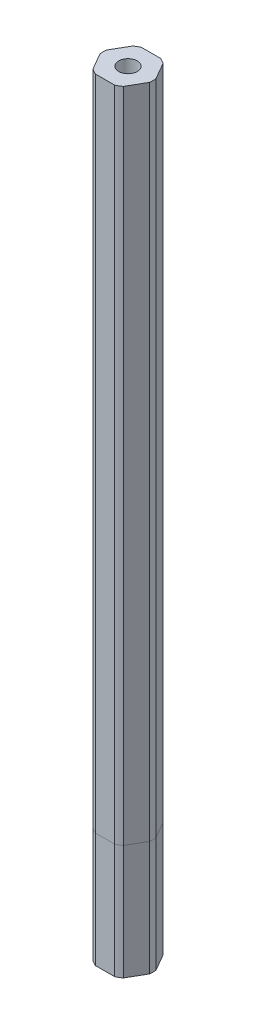
ISO-10303-21;
HEADER;
FILE_DESCRIPTION(('STEP AP214'),'2;1');
FILE_NAME('part.step','',(''),(''),'','','');
FILE_SCHEMA(('AUTOMOTIVE_DESIGN { 1 0 10303 214 1 1 1 1 }'));
ENDSEC;
DATA;
#1=APPLICATION_CONTEXT('core data for automotive mechanical design processes');
#2=APPLICATION_PROTOCOL_DEFINITION('international standard','automotive_design',2000,#1);
#3=PRODUCT_CONTEXT('',#1,'mechanical');
#4=PRODUCT('Part','Part','',(#3));
#5=PRODUCT_RELATED_PRODUCT_CATEGORY('part','',(#4));
#6=PRODUCT_DEFINITION_FORMATION('','',#4);
#7=PRODUCT_DEFINITION_CONTEXT('part definition',#1,'design');
#8=PRODUCT_DEFINITION('design','',#6,#7);
#9=PRODUCT_DEFINITION_SHAPE('','',#8);
#10=(LENGTH_UNIT() NAMED_UNIT(*) SI_UNIT(.MILLI.,.METRE.));
#11=(NAMED_UNIT(*) PLANE_ANGLE_UNIT() SI_UNIT($,.RADIAN.));
#12=(NAMED_UNIT(*) SI_UNIT($,.STERADIAN.) SOLID_ANGLE_UNIT());
#13=UNCERTAINTY_MEASURE_WITH_UNIT(LENGTH_MEASURE(1.E-05),#10,'distance_accuracy_value','');
#14=(GEOMETRIC_REPRESENTATION_CONTEXT(3) GLOBAL_UNCERTAINTY_ASSIGNED_CONTEXT((#13)) GLOBAL_UNIT_ASSIGNED_CONTEXT((#10,
#11,#12)) REPRESENTATION_CONTEXT('',''));
#15=CARTESIAN_POINT('',(0.,0.,0.));
#16=DIRECTION('',(0.,0.,1.));
#17=DIRECTION('',(1.,0.,0.));
#18=AXIS2_PLACEMENT_3D('',#15,#16,#17);
#19=CARTESIAN_POINT('',(0.,212.725,0.));
#20=DIRECTION('',(0.,1.,0.));
#21=DIRECTION('',(0.,0.,1.));
#22=AXIS2_PLACEMENT_3D('',#19,#20,#21);
#23=PLANE('',#22);
#24=CARTESIAN_POINT('',(0.,212.725,0.));
#25=DIRECTION('',(0.,1.,0.));
#26=DIRECTION('',(0.,0.,1.));
#27=AXIS2_PLACEMENT_3D('',#24,#25,#26);
#28=CIRCLE('',#27,6.87578);
#29=CARTESIAN_POINT('',(4.18075357719381,212.725,-5.45872239037498));
#30=VERTEX_POINT('',#29);
#31=CARTESIAN_POINT('',(2.63701547367471,212.725,-6.35000000000001));
#32=VERTEX_POINT('',#31);
#33=EDGE_CURVE('E189',#30,#32,#28,.T.);
#34=ORIENTED_EDGE('',*,*,#33,.T.);
#35=DIRECTION('',(-1.,0.,0.));
#36=VECTOR('',#35,1.);
#37=CARTESIAN_POINT('',(2.63701547367471,212.725,-6.35000000000001));
#38=LINE('',#37,#36);
#39=CARTESIAN_POINT('',(-2.63701547367476,212.725,-6.34999999999999));
#40=VERTEX_POINT('',#39);
#41=EDGE_CURVE('E117',#32,#40,#38,.T.);
#42=ORIENTED_EDGE('',*,*,#41,.T.);
#43=CARTESIAN_POINT('',(0.,212.725,0.));
#44=DIRECTION('',(0.,1.,0.));
#45=DIRECTION('',(0.,0.,1.));
#46=AXIS2_PLACEMENT_3D('',#43,#44,#45);
#47=CIRCLE('',#46,6.87578);
#48=CARTESIAN_POINT('',(-4.18075357719384,212.725,-5.45872239037496));
#49=VERTEX_POINT('',#48);
#50=EDGE_CURVE('E216',#40,#49,#47,.T.);
#51=ORIENTED_EDGE('',*,*,#50,.T.);
#52=DIRECTION('',(-0.499999999999995,0.,0.866025403784441));
#53=VECTOR('',#52,1.);
#54=CARTESIAN_POINT('',(-4.18075357719384,212.725,-5.45872239037496));
#55=LINE('',#54,#53);
#56=CARTESIAN_POINT('',(-6.81776905086856,212.725,-0.891277609624982));
#57=VERTEX_POINT('',#56);
#58=EDGE_CURVE('E235',#49,#57,#55,.T.);
#59=ORIENTED_EDGE('',*,*,#58,.T.);
#60=CARTESIAN_POINT('',(0.,212.725,0.));
#61=DIRECTION('',(0.,1.,0.));
#62=DIRECTION('',(0.,0.,1.));
#63=AXIS2_PLACEMENT_3D('',#60,#61,#62);
#64=CIRCLE('',#63,6.87578);
#65=CARTESIAN_POINT('',(-6.81776905086855,212.725,0.891277609625074));
#66=VERTEX_POINT('',#65);
#67=EDGE_CURVE('E232',#57,#66,#64,.T.);
#68=ORIENTED_EDGE('',*,*,#67,.T.);
#69=DIRECTION('',(0.500000000000007,0.,0.866025403784435));
#70=VECTOR('',#69,1.);
#71=CARTESIAN_POINT('',(-6.81776905086855,212.725,0.891277609625074));
#72=LINE('',#71,#70);
#73=CARTESIAN_POINT('',(-4.18075357719377,212.725,5.45872239037501));
#74=VERTEX_POINT('',#73);
#75=EDGE_CURVE('E234',#66,#74,#72,.T.);
#76=ORIENTED_EDGE('',*,*,#75,.T.);
#77=CARTESIAN_POINT('',(0.,212.725,0.));
#78=DIRECTION('',(0.,1.,0.));
#79=DIRECTION('',(0.,0.,1.));
#80=AXIS2_PLACEMENT_3D('',#77,#78,#79);
#81=CIRCLE('',#80,6.87578);
#82=CARTESIAN_POINT('',(-2.63701547367468,212.725,6.35000000000002));
#83=VERTEX_POINT('',#82);
#84=EDGE_CURVE('E237',#74,#83,#81,.T.);
#85=ORIENTED_EDGE('',*,*,#84,.T.);
#86=DIRECTION('',(1.,0.,0.));
#87=VECTOR('',#86,1.);
#88=CARTESIAN_POINT('',(-2.63701547367468,212.725,6.35000000000002));
#89=LINE('',#88,#87);
#90=CARTESIAN_POINT('',(2.6370154736748,212.725,6.34999999999997));
#91=VERTEX_POINT('',#90);
#92=EDGE_CURVE('E243',#83,#91,#89,.T.);
#93=ORIENTED_EDGE('',*,*,#92,.T.);
#94=CARTESIAN_POINT('',(0.,212.725,0.));
#95=DIRECTION('',(0.,1.,0.));
#96=DIRECTION('',(0.,0.,1.));
#97=AXIS2_PLACEMENT_3D('',#94,#95,#96);
#98=CIRCLE('',#97,6.87578);
#99=CARTESIAN_POINT('',(4.1807535771939,212.725,5.45872239037491));
#100=VERTEX_POINT('',#99);
#101=EDGE_CURVE('E148',#91,#100,#98,.T.);
#102=ORIENTED_EDGE('',*,*,#101,.T.);
#103=DIRECTION('',(0.499999999999995,0.,-0.866025403784441));
#104=VECTOR('',#103,1.);
#105=CARTESIAN_POINT('',(4.1807535771939,212.725,5.45872239037491));
#106=LINE('',#105,#104);
#107=CARTESIAN_POINT('',(6.81776905086855,212.725,0.891277609625056));
#108=VERTEX_POINT('',#107);
#109=EDGE_CURVE('E142',#100,#108,#106,.T.);
#110=ORIENTED_EDGE('',*,*,#109,.T.);
#111=CARTESIAN_POINT('',(0.,212.725,0.));
#112=DIRECTION('',(0.,1.,0.));
#113=DIRECTION('',(0.,0.,1.));
#114=AXIS2_PLACEMENT_3D('',#111,#112,#113);
#115=CIRCLE('',#114,6.87578);
#116=CARTESIAN_POINT('',(6.81776905086855,212.725,-0.891277609625029));
#117=VERTEX_POINT('',#116);
#118=EDGE_CURVE('E146',#108,#117,#115,.T.);
#119=ORIENTED_EDGE('',*,*,#118,.T.);
#120=DIRECTION('',(-0.500000000000001,0.,-0.866025403784438));
#121=VECTOR('',#120,1.);
#122=CARTESIAN_POINT('',(6.81776905086855,212.725,-0.891277609625029));
#123=LINE('',#122,#121);
#124=EDGE_CURVE('E62',#117,#30,#123,.T.);
#125=ORIENTED_EDGE('',*,*,#124,.T.);
#126=EDGE_LOOP('',(#34,#42,#51,#59,#68,#76,#85,#93,#102,#110,#119,#125));
#127=FACE_BOUND('',#126,.T.);
#128=CARTESIAN_POINT('',(0.,212.725,0.));
#129=DIRECTION('',(0.,1.,0.));
#130=DIRECTION('',(0.,0.,1.));
#131=AXIS2_PLACEMENT_3D('',#128,#129,#130);
#132=CIRCLE('',#131,2.5527);
#133=CARTESIAN_POINT('',(0.,212.725,2.5527));
#134=VERTEX_POINT('',#133);
#135=EDGE_CURVE('E170',#134,#134,#132,.T.);
#136=ORIENTED_EDGE('',*,*,#135,.F.);
#137=EDGE_LOOP('',(#136));
#138=FACE_BOUND('',#137,.T.);
#139=ADVANCED_FACE('F45',(#127,#138),#23,.T.);
#140=CARTESIAN_POINT('',(0.,31.623,0.));
#141=DIRECTION('',(0.,1.,0.));
#142=DIRECTION('',(0.,0.,1.));
#143=AXIS2_PLACEMENT_3D('',#140,#141,#142);
#144=PLANE('',#143);
#145=CARTESIAN_POINT('',(0.,31.623,0.));
#146=DIRECTION('',(0.,1.,0.));
#147=DIRECTION('',(0.,0.,1.));
#148=AXIS2_PLACEMENT_3D('',#145,#146,#147);
#149=CIRCLE('',#148,6.87578);
#150=CARTESIAN_POINT('',(4.18075357719381,31.623,-5.45872239037498));
#151=VERTEX_POINT('',#150);
#152=CARTESIAN_POINT('',(2.63701547367471,31.623,-6.35000000000001));
#153=VERTEX_POINT('',#152);
#154=EDGE_CURVE('E166',#151,#153,#149,.T.);
#155=ORIENTED_EDGE('',*,*,#154,.F.);
#156=DIRECTION('',(-0.500000000000001,0.,-0.866025403784438));
#157=VECTOR('',#156,1.);
#158=CARTESIAN_POINT('',(6.81776905086855,31.623,-0.891277609625029));
#159=LINE('',#158,#157);
#160=CARTESIAN_POINT('',(6.81776905086855,31.623,-0.891277609625029));
#161=VERTEX_POINT('',#160);
#162=EDGE_CURVE('E109',#161,#151,#159,.T.);
#163=ORIENTED_EDGE('',*,*,#162,.F.);
#164=CARTESIAN_POINT('',(0.,31.623,0.));
#165=DIRECTION('',(0.,1.,0.));
#166=DIRECTION('',(0.,0.,1.));
#167=AXIS2_PLACEMENT_3D('',#164,#165,#166);
#168=CIRCLE('',#167,6.87578);
#169=CARTESIAN_POINT('',(6.81776905086855,31.623,0.891277609625056));
#170=VERTEX_POINT('',#169);
#171=EDGE_CURVE('E103',#170,#161,#168,.T.);
#172=ORIENTED_EDGE('',*,*,#171,.F.);
#173=DIRECTION('',(0.499999999999995,0.,-0.866025403784441));
#174=VECTOR('',#173,1.);
#175=CARTESIAN_POINT('',(4.1807535771939,31.623,5.45872239037491));
#176=LINE('',#175,#174);
#177=CARTESIAN_POINT('',(4.1807535771939,31.623,5.45872239037491));
#178=VERTEX_POINT('',#177);
#179=EDGE_CURVE('E156',#178,#170,#176,.T.);
#180=ORIENTED_EDGE('',*,*,#179,.F.);
#181=CARTESIAN_POINT('',(0.,31.623,0.));
#182=DIRECTION('',(0.,1.,0.));
#183=DIRECTION('',(0.,0.,1.));
#184=AXIS2_PLACEMENT_3D('',#181,#182,#183);
#185=CIRCLE('',#184,6.87578);
#186=CARTESIAN_POINT('',(2.6370154736748,31.623,6.34999999999997));
#187=VERTEX_POINT('',#186);
#188=EDGE_CURVE('E184',#187,#178,#185,.T.);
#189=ORIENTED_EDGE('',*,*,#188,.F.);
#190=DIRECTION('',(1.,0.,0.));
#191=VECTOR('',#190,1.);
#192=CARTESIAN_POINT('',(-2.63701547367468,31.623,6.35000000000002));
#193=LINE('',#192,#191);
#194=CARTESIAN_POINT('',(-2.63701547367468,31.623,6.35000000000002));
#195=VERTEX_POINT('',#194);
#196=EDGE_CURVE('E182',#195,#187,#193,.T.);
#197=ORIENTED_EDGE('',*,*,#196,.F.);
#198=CARTESIAN_POINT('',(0.,31.623,0.));
#199=DIRECTION('',(0.,1.,0.));
#200=DIRECTION('',(0.,0.,1.));
#201=AXIS2_PLACEMENT_3D('',#198,#199,#200);
#202=CIRCLE('',#201,6.87578);
#203=CARTESIAN_POINT('',(-4.18075357719377,31.623,5.45872239037501));
#204=VERTEX_POINT('',#203);
#205=EDGE_CURVE('E180',#204,#195,#202,.T.);
#206=ORIENTED_EDGE('',*,*,#205,.F.);
#207=DIRECTION('',(0.500000000000007,0.,0.866025403784435));
#208=VECTOR('',#207,1.);
#209=CARTESIAN_POINT('',(-6.81776905086855,31.623,0.891277609625074));
#210=LINE('',#209,#208);
#211=CARTESIAN_POINT('',(-6.81776905086855,31.623,0.891277609625074));
#212=VERTEX_POINT('',#211);
#213=EDGE_CURVE('E178',#212,#204,#210,.T.);
#214=ORIENTED_EDGE('',*,*,#213,.F.);
#215=CARTESIAN_POINT('',(0.,31.623,0.));
#216=DIRECTION('',(0.,1.,0.));
#217=DIRECTION('',(0.,0.,1.));
#218=AXIS2_PLACEMENT_3D('',#215,#216,#217);
#219=CIRCLE('',#218,6.87578);
#220=CARTESIAN_POINT('',(-6.81776905086856,31.623,-0.891277609624982));
#221=VERTEX_POINT('',#220);
#222=EDGE_CURVE('E176',#221,#212,#219,.T.);
#223=ORIENTED_EDGE('',*,*,#222,.F.);
#224=DIRECTION('',(-0.499999999999995,0.,0.866025403784441));
#225=VECTOR('',#224,1.);
#226=CARTESIAN_POINT('',(-4.18075357719384,31.623,-5.45872239037496));
#227=LINE('',#226,#225);
#228=CARTESIAN_POINT('',(-4.18075357719384,31.623,-5.45872239037496));
#229=VERTEX_POINT('',#228);
#230=EDGE_CURVE('E174',#229,#221,#227,.T.);
#231=ORIENTED_EDGE('',*,*,#230,.F.);
#232=CARTESIAN_POINT('',(0.,31.623,0.));
#233=DIRECTION('',(0.,1.,0.));
#234=DIRECTION('',(0.,0.,1.));
#235=AXIS2_PLACEMENT_3D('',#232,#233,#234);
#236=CIRCLE('',#235,6.87578);
#237=CARTESIAN_POINT('',(-2.63701547367476,31.623,-6.34999999999999));
#238=VERTEX_POINT('',#237);
#239=EDGE_CURVE('E172',#238,#229,#236,.T.);
#240=ORIENTED_EDGE('',*,*,#239,.F.);
#241=DIRECTION('',(-1.,0.,0.));
#242=VECTOR('',#241,1.);
#243=CARTESIAN_POINT('',(2.63701547367471,31.623,-6.35000000000001));
#244=LINE('',#243,#242);
#245=EDGE_CURVE('E169',#153,#238,#244,.T.);
#246=ORIENTED_EDGE('',*,*,#245,.F.);
#247=EDGE_LOOP('',(#155,#163,#172,#180,#189,#197,#206,#214,#223,#231,#240,#246));
#248=FACE_BOUND('',#247,.T.);
#249=CARTESIAN_POINT('',(0.,31.623,0.));
#250=DIRECTION('',(0.,1.,0.));
#251=DIRECTION('',(0.,0.,1.));
#252=AXIS2_PLACEMENT_3D('',#249,#250,#251);
#253=CIRCLE('',#252,2.5527);
#254=CARTESIAN_POINT('',(0.,31.623,2.5527));
#255=VERTEX_POINT('',#254);
#256=EDGE_CURVE('E390',#255,#255,#253,.T.);
#257=ORIENTED_EDGE('',*,*,#256,.T.);
#258=EDGE_LOOP('',(#257));
#259=FACE_BOUND('',#258,.T.);
#260=ADVANCED_FACE('F220',(#248,#259),#144,.F.);
#261=CARTESIAN_POINT('',(0.,212.725,0.));
#262=DIRECTION('',(0.,-1.,0.));
#263=DIRECTION('',(0.,0.,-1.));
#264=AXIS2_PLACEMENT_3D('',#261,#262,#263);
#265=CYLINDRICAL_SURFACE('',#264,6.87578);
#266=ORIENTED_EDGE('',*,*,#154,.T.);
#267=DIRECTION('',(0.,-1.,0.));
#268=VECTOR('',#267,1.);
#269=CARTESIAN_POINT('',(2.63701547367471,212.725,-6.35000000000001));
#270=LINE('',#269,#268);
#271=EDGE_CURVE('E12',#32,#153,#270,.T.);
#272=ORIENTED_EDGE('',*,*,#271,.F.);
#273=ORIENTED_EDGE('',*,*,#33,.F.);
#274=DIRECTION('',(0.,-1.,0.));
#275=VECTOR('',#274,1.);
#276=CARTESIAN_POINT('',(4.18075357719381,212.725,-5.45872239037498));
#277=LINE('',#276,#275);
#278=EDGE_CURVE('E162',#30,#151,#277,.T.);
#279=ORIENTED_EDGE('',*,*,#278,.T.);
#280=EDGE_LOOP('',(#266,#272,#273,#279));
#281=FACE_BOUND('',#280,.T.);
#282=ADVANCED_FACE('F47',(#281),#265,.T.);
#283=CARTESIAN_POINT('',(2.63701547367471,212.725,-6.35000000000001));
#284=DIRECTION('',(0.,0.,1.));
#285=DIRECTION('',(1.,0.,0.));
#286=AXIS2_PLACEMENT_3D('',#283,#284,#285);
#287=PLANE('',#286);
#288=ORIENTED_EDGE('',*,*,#245,.T.);
#289=DIRECTION('',(0.,-1.,0.));
#290=VECTOR('',#289,1.);
#291=CARTESIAN_POINT('',(-2.63701547367476,212.725,-6.34999999999999));
#292=LINE('',#291,#290);
#293=EDGE_CURVE('E54',#40,#238,#292,.T.);
#294=ORIENTED_EDGE('',*,*,#293,.F.);
#295=ORIENTED_EDGE('',*,*,#41,.F.);
#296=ORIENTED_EDGE('',*,*,#271,.T.);
#297=EDGE_LOOP('',(#288,#294,#295,#296));
#298=FACE_BOUND('',#297,.T.);
#299=ADVANCED_FACE('F277',(#298),#287,.F.);
#300=CARTESIAN_POINT('',(0.,212.725,0.));
#301=DIRECTION('',(0.,-1.,0.));
#302=DIRECTION('',(0.,0.,-1.));
#303=AXIS2_PLACEMENT_3D('',#300,#301,#302);
#304=CYLINDRICAL_SURFACE('',#303,6.87578);
#305=ORIENTED_EDGE('',*,*,#239,.T.);
#306=DIRECTION('',(0.,-1.,0.));
#307=VECTOR('',#306,1.);
#308=CARTESIAN_POINT('',(-4.18075357719384,212.725,-5.45872239037496));
#309=LINE('',#308,#307);
#310=EDGE_CURVE('E208',#49,#229,#309,.T.);
#311=ORIENTED_EDGE('',*,*,#310,.F.);
#312=ORIENTED_EDGE('',*,*,#50,.F.);
#313=ORIENTED_EDGE('',*,*,#293,.T.);
#314=EDGE_LOOP('',(#305,#311,#312,#313));
#315=FACE_BOUND('',#314,.T.);
#316=ADVANCED_FACE('F214',(#315),#304,.T.);
#317=CARTESIAN_POINT('',(-4.18075357719384,212.725,-5.45872239037496));
#318=DIRECTION('',(0.866025403784441,0.,0.499999999999995));
#319=DIRECTION('',(0.499999999999995,0.,-0.866025403784442));
#320=AXIS2_PLACEMENT_3D('',#317,#318,#319);
#321=PLANE('',#320);
#322=ORIENTED_EDGE('',*,*,#230,.T.);
#323=DIRECTION('',(0.,-1.,0.));
#324=VECTOR('',#323,1.);
#325=CARTESIAN_POINT('',(-6.81776905086856,212.725,-0.891277609624982));
#326=LINE('',#325,#324);
#327=EDGE_CURVE('E205',#57,#221,#326,.T.);
#328=ORIENTED_EDGE('',*,*,#327,.F.);
#329=ORIENTED_EDGE('',*,*,#58,.F.);
#330=ORIENTED_EDGE('',*,*,#310,.T.);
#331=EDGE_LOOP('',(#322,#328,#329,#330));
#332=FACE_BOUND('',#331,.T.);
#333=ADVANCED_FACE('F226',(#332),#321,.F.);
#334=CARTESIAN_POINT('',(0.,212.725,0.));
#335=DIRECTION('',(0.,-1.,0.));
#336=DIRECTION('',(0.,0.,-1.));
#337=AXIS2_PLACEMENT_3D('',#334,#335,#336);
#338=CYLINDRICAL_SURFACE('',#337,6.87578);
#339=ORIENTED_EDGE('',*,*,#222,.T.);
#340=DIRECTION('',(0.,-1.,0.));
#341=VECTOR('',#340,1.);
#342=CARTESIAN_POINT('',(-6.81776905086855,212.725,0.891277609625074));
#343=LINE('',#342,#341);
#344=EDGE_CURVE('E202',#66,#212,#343,.T.);
#345=ORIENTED_EDGE('',*,*,#344,.F.);
#346=ORIENTED_EDGE('',*,*,#67,.F.);
#347=ORIENTED_EDGE('',*,*,#327,.T.);
#348=EDGE_LOOP('',(#339,#345,#346,#347));
#349=FACE_BOUND('',#348,.T.);
#350=ADVANCED_FACE('F230',(#349),#338,.T.);
#351=CARTESIAN_POINT('',(-6.81776905086855,212.725,0.891277609625074));
#352=DIRECTION('',(0.866025403784435,0.,-0.500000000000007));
#353=DIRECTION('',(-0.500000000000007,0.,-0.866025403784435));
#354=AXIS2_PLACEMENT_3D('',#351,#352,#353);
#355=PLANE('',#354);
#356=ORIENTED_EDGE('',*,*,#213,.T.);
#357=DIRECTION('',(0.,-1.,0.));
#358=VECTOR('',#357,1.);
#359=CARTESIAN_POINT('',(-4.18075357719377,212.725,5.45872239037501));
#360=LINE('',#359,#358);
#361=EDGE_CURVE('E199',#74,#204,#360,.T.);
#362=ORIENTED_EDGE('',*,*,#361,.F.);
#363=ORIENTED_EDGE('',*,*,#75,.F.);
#364=ORIENTED_EDGE('',*,*,#344,.T.);
#365=EDGE_LOOP('',(#356,#362,#363,#364));
#366=FACE_BOUND('',#365,.T.);
#367=ADVANCED_FACE('F290',(#366),#355,.F.);
#368=CARTESIAN_POINT('',(0.,212.725,0.));
#369=DIRECTION('',(0.,-1.,0.));
#370=DIRECTION('',(0.,0.,-1.));
#371=AXIS2_PLACEMENT_3D('',#368,#369,#370);
#372=CYLINDRICAL_SURFACE('',#371,6.87578);
#373=ORIENTED_EDGE('',*,*,#205,.T.);
#374=DIRECTION('',(0.,-1.,0.));
#375=VECTOR('',#374,1.);
#376=CARTESIAN_POINT('',(-2.63701547367468,212.725,6.35000000000002));
#377=LINE('',#376,#375);
#378=EDGE_CURVE('E196',#83,#195,#377,.T.);
#379=ORIENTED_EDGE('',*,*,#378,.F.);
#380=ORIENTED_EDGE('',*,*,#84,.F.);
#381=ORIENTED_EDGE('',*,*,#361,.T.);
#382=EDGE_LOOP('',(#373,#379,#380,#381));
#383=FACE_BOUND('',#382,.T.);
#384=ADVANCED_FACE('F293',(#383),#372,.T.);
#385=CARTESIAN_POINT('',(-2.63701547367468,212.725,6.35000000000002));
#386=DIRECTION('',(0.,0.,-1.));
#387=DIRECTION('',(-1.,0.,0.));
#388=AXIS2_PLACEMENT_3D('',#385,#386,#387);
#389=PLANE('',#388);
#390=ORIENTED_EDGE('',*,*,#196,.T.);
#391=DIRECTION('',(0.,-1.,0.));
#392=VECTOR('',#391,1.);
#393=CARTESIAN_POINT('',(2.6370154736748,212.725,6.34999999999997));
#394=LINE('',#393,#392);
#395=EDGE_CURVE('E193',#91,#187,#394,.T.);
#396=ORIENTED_EDGE('',*,*,#395,.F.);
#397=ORIENTED_EDGE('',*,*,#92,.F.);
#398=ORIENTED_EDGE('',*,*,#378,.T.);
#399=EDGE_LOOP('',(#390,#396,#397,#398));
#400=FACE_BOUND('',#399,.T.);
#401=ADVANCED_FACE('F249',(#400),#389,.F.);
#402=CARTESIAN_POINT('',(0.,212.725,0.));
#403=DIRECTION('',(0.,-1.,0.));
#404=DIRECTION('',(0.,0.,-1.));
#405=AXIS2_PLACEMENT_3D('',#402,#403,#404);
#406=CYLINDRICAL_SURFACE('',#405,6.87578);
#407=ORIENTED_EDGE('',*,*,#188,.T.);
#408=DIRECTION('',(0.,-1.,0.));
#409=VECTOR('',#408,1.);
#410=CARTESIAN_POINT('',(4.1807535771939,212.725,5.45872239037491));
#411=LINE('',#410,#409);
#412=EDGE_CURVE('E157',#100,#178,#411,.T.);
#413=ORIENTED_EDGE('',*,*,#412,.F.);
#414=ORIENTED_EDGE('',*,*,#101,.F.);
#415=ORIENTED_EDGE('',*,*,#395,.T.);
#416=EDGE_LOOP('',(#407,#413,#414,#415));
#417=FACE_BOUND('',#416,.T.);
#418=ADVANCED_FACE('F253',(#417),#406,.T.);
#419=CARTESIAN_POINT('',(4.1807535771939,212.725,5.45872239037491));
#420=DIRECTION('',(-0.866025403784441,0.,-0.499999999999995));
#421=DIRECTION('',(-0.499999999999995,0.,0.866025403784441));
#422=AXIS2_PLACEMENT_3D('',#419,#420,#421);
#423=PLANE('',#422);
#424=ORIENTED_EDGE('',*,*,#179,.T.);
#425=DIRECTION('',(0.,-1.,0.));
#426=VECTOR('',#425,1.);
#427=CARTESIAN_POINT('',(6.81776905086855,212.725,0.891277609625056));
#428=LINE('',#427,#426);
#429=EDGE_CURVE('E153',#108,#170,#428,.T.);
#430=ORIENTED_EDGE('',*,*,#429,.F.);
#431=ORIENTED_EDGE('',*,*,#109,.F.);
#432=ORIENTED_EDGE('',*,*,#412,.T.);
#433=EDGE_LOOP('',(#424,#430,#431,#432));
#434=FACE_BOUND('',#433,.T.);
#435=ADVANCED_FACE('F154',(#434),#423,.F.);
#436=CARTESIAN_POINT('',(0.,212.725,0.));
#437=DIRECTION('',(0.,-1.,0.));
#438=DIRECTION('',(0.,0.,-1.));
#439=AXIS2_PLACEMENT_3D('',#436,#437,#438);
#440=CYLINDRICAL_SURFACE('',#439,6.87578);
#441=ORIENTED_EDGE('',*,*,#171,.T.);
#442=DIRECTION('',(0.,-1.,0.));
#443=VECTOR('',#442,1.);
#444=CARTESIAN_POINT('',(6.81776905086855,212.725,-0.891277609625029));
#445=LINE('',#444,#443);
#446=EDGE_CURVE('E158',#117,#161,#445,.T.);
#447=ORIENTED_EDGE('',*,*,#446,.F.);
#448=ORIENTED_EDGE('',*,*,#118,.F.);
#449=ORIENTED_EDGE('',*,*,#429,.T.);
#450=EDGE_LOOP('',(#441,#447,#448,#449));
#451=FACE_BOUND('',#450,.T.);
#452=ADVANCED_FACE('F160',(#451),#440,.T.);
#453=CARTESIAN_POINT('',(6.81776905086855,212.725,-0.891277609625029));
#454=DIRECTION('',(-0.866025403784438,0.,0.500000000000001));
#455=DIRECTION('',(0.500000000000001,0.,0.866025403784438));
#456=AXIS2_PLACEMENT_3D('',#453,#454,#455);
#457=PLANE('',#456);
#458=ORIENTED_EDGE('',*,*,#162,.T.);
#459=ORIENTED_EDGE('',*,*,#278,.F.);
#460=ORIENTED_EDGE('',*,*,#124,.F.);
#461=ORIENTED_EDGE('',*,*,#446,.T.);
#462=EDGE_LOOP('',(#458,#459,#460,#461));
#463=FACE_BOUND('',#462,.T.);
#464=ADVANCED_FACE('F257',(#463),#457,.F.);
#465=CARTESIAN_POINT('',(0.,212.725,0.));
#466=DIRECTION('',(0.,-1.,0.));
#467=DIRECTION('',(0.,0.,-1.));
#468=AXIS2_PLACEMENT_3D('',#465,#466,#467);
#469=CYLINDRICAL_SURFACE('',#468,2.5527);
#470=ORIENTED_EDGE('',*,*,#135,.T.);
#471=EDGE_LOOP('',(#470));
#472=FACE_BOUND('',#471,.T.);
#473=ORIENTED_EDGE('',*,*,#256,.F.);
#474=EDGE_LOOP('',(#473));
#475=FACE_BOUND('',#474,.T.);
#476=ADVANCED_FACE('F259',(#472,#475),#469,.F.);
#477=CLOSED_SHELL('',(#139,#260,#282,#299,#316,#333,#350,#367,#384,#401,#418,#435,#452,#464,#476));
#478=MANIFOLD_SOLID_BREP('B2',#477);
#479=CARTESIAN_POINT('',(0.,31.623,0.));
#480=DIRECTION('',(0.,1.,0.));
#481=DIRECTION('',(0.,0.,1.));
#482=AXIS2_PLACEMENT_3D('',#479,#480,#481);
#483=PLANE('',#482);
#484=CARTESIAN_POINT('',(0.,31.623,0.));
#485=DIRECTION('',(0.,1.,0.));
#486=DIRECTION('',(0.,0.,1.));
#487=AXIS2_PLACEMENT_3D('',#484,#485,#486);
#488=CIRCLE('',#487,6.87578);
#489=CARTESIAN_POINT('',(6.81776905086855,31.623,0.891277609625051));
#490=VERTEX_POINT('',#489);
#491=CARTESIAN_POINT('',(6.81776905086855,31.623,-0.891277609625029));
#492=VERTEX_POINT('',#491);
#493=EDGE_CURVE('E542',#490,#492,#488,.T.);
#494=ORIENTED_EDGE('',*,*,#493,.T.);
#495=DIRECTION('',(-0.500000000000001,0.,-0.866025403784438));
#496=VECTOR('',#495,1.);
#497=CARTESIAN_POINT('',(6.81776905086855,31.623,-0.891277609625029));
#498=LINE('',#497,#496);
#499=CARTESIAN_POINT('',(4.18075357719381,31.623,-5.45872239037498));
#500=VERTEX_POINT('',#499);
#501=EDGE_CURVE('E470',#492,#500,#498,.T.);
#502=ORIENTED_EDGE('',*,*,#501,.T.);
#503=CARTESIAN_POINT('',(0.,31.623,0.));
#504=DIRECTION('',(0.,1.,0.));
#505=DIRECTION('',(0.,0.,1.));
#506=AXIS2_PLACEMENT_3D('',#503,#504,#505);
#507=CIRCLE('',#506,6.87578);
#508=CARTESIAN_POINT('',(2.63701547367471,31.623,-6.35000000000001));
#509=VERTEX_POINT('',#508);
#510=EDGE_CURVE('E569',#500,#509,#507,.T.);
#511=ORIENTED_EDGE('',*,*,#510,.T.);
#512=DIRECTION('',(-1.,0.,0.));
#513=VECTOR('',#512,1.);
#514=CARTESIAN_POINT('',(2.63701547367471,31.623,-6.35000000000001));
#515=LINE('',#514,#513);
#516=CARTESIAN_POINT('',(-2.63701547367476,31.623,-6.34999999999999));
#517=VERTEX_POINT('',#516);
#518=EDGE_CURVE('E588',#509,#517,#515,.T.);
#519=ORIENTED_EDGE('',*,*,#518,.T.);
#520=CARTESIAN_POINT('',(0.,31.623,0.));
#521=DIRECTION('',(0.,1.,0.));
#522=DIRECTION('',(0.,0.,1.));
#523=AXIS2_PLACEMENT_3D('',#520,#521,#522);
#524=CIRCLE('',#523,6.87578);
#525=CARTESIAN_POINT('',(-4.18075357719384,31.623,-5.45872239037496));
#526=VERTEX_POINT('',#525);
#527=EDGE_CURVE('E585',#517,#526,#524,.T.);
#528=ORIENTED_EDGE('',*,*,#527,.T.);
#529=DIRECTION('',(-0.499999999999995,0.,0.866025403784441));
#530=VECTOR('',#529,1.);
#531=CARTESIAN_POINT('',(-4.18075357719385,31.623,-5.45872239037495));
#532=LINE('',#531,#530);
#533=CARTESIAN_POINT('',(-6.81776905086856,31.623,-0.891277609624981));
#534=VERTEX_POINT('',#533);
#535=EDGE_CURVE('E587',#526,#534,#532,.T.);
#536=ORIENTED_EDGE('',*,*,#535,.T.);
#537=CARTESIAN_POINT('',(0.,31.623,0.));
#538=DIRECTION('',(0.,1.,0.));
#539=DIRECTION('',(0.,0.,1.));
#540=AXIS2_PLACEMENT_3D('',#537,#538,#539);
#541=CIRCLE('',#540,6.87578);
#542=CARTESIAN_POINT('',(-6.81776905086855,31.623,0.891277609625076));
#543=VERTEX_POINT('',#542);
#544=EDGE_CURVE('E590',#534,#543,#541,.T.);
#545=ORIENTED_EDGE('',*,*,#544,.T.);
#546=DIRECTION('',(0.500000000000007,0.,0.866025403784435));
#547=VECTOR('',#546,1.);
#548=CARTESIAN_POINT('',(-6.81776905086855,31.623,0.891277609625075));
#549=LINE('',#548,#547);
#550=CARTESIAN_POINT('',(-4.18075357719377,31.623,5.45872239037501));
#551=VERTEX_POINT('',#550);
#552=EDGE_CURVE('E596',#543,#551,#549,.T.);
#553=ORIENTED_EDGE('',*,*,#552,.T.);
#554=CARTESIAN_POINT('',(0.,31.623,0.));
#555=DIRECTION('',(0.,1.,0.));
#556=DIRECTION('',(0.,0.,1.));
#557=AXIS2_PLACEMENT_3D('',#554,#555,#556);
#558=CIRCLE('',#557,6.87578);
#559=CARTESIAN_POINT('',(-2.63701547367468,31.623,6.35000000000002));
#560=VERTEX_POINT('',#559);
#561=EDGE_CURVE('E501',#551,#560,#558,.T.);
#562=ORIENTED_EDGE('',*,*,#561,.T.);
#563=DIRECTION('',(1.,0.,0.));
#564=VECTOR('',#563,1.);
#565=CARTESIAN_POINT('',(-2.63701547367467,31.623,6.35000000000002));
#566=LINE('',#565,#564);
#567=CARTESIAN_POINT('',(2.63701547367481,31.623,6.34999999999997));
#568=VERTEX_POINT('',#567);
#569=EDGE_CURVE('E495',#560,#568,#566,.T.);
#570=ORIENTED_EDGE('',*,*,#569,.T.);
#571=CARTESIAN_POINT('',(0.,31.623,0.));
#572=DIRECTION('',(0.,1.,0.));
#573=DIRECTION('',(0.,0.,1.));
#574=AXIS2_PLACEMENT_3D('',#571,#572,#573);
#575=CIRCLE('',#574,6.87578);
#576=CARTESIAN_POINT('',(4.1807535771939,31.623,5.45872239037491));
#577=VERTEX_POINT('',#576);
#578=EDGE_CURVE('E499',#568,#577,#575,.T.);
#579=ORIENTED_EDGE('',*,*,#578,.T.);
#580=DIRECTION('',(0.499999999999995,0.,-0.866025403784441));
#581=VECTOR('',#580,1.);
#582=CARTESIAN_POINT('',(4.1807535771939,31.623,5.45872239037491));
#583=LINE('',#582,#581);
#584=EDGE_CURVE('E415',#577,#490,#583,.T.);
#585=ORIENTED_EDGE('',*,*,#584,.T.);
#586=EDGE_LOOP('',(#494,#502,#511,#519,#528,#536,#545,#553,#562,#570,#579,#585));
#587=FACE_BOUND('',#586,.T.);
#588=CARTESIAN_POINT('',(0.,31.623,0.));
#589=DIRECTION('',(0.,1.,0.));
#590=DIRECTION('',(0.,0.,1.));
#591=AXIS2_PLACEMENT_3D('',#588,#589,#590);
#592=CIRCLE('',#591,4.0005);
#593=CARTESIAN_POINT('',(0.,31.623,4.0005));
#594=VERTEX_POINT('',#593);
#595=EDGE_CURVE('E523',#594,#594,#592,.T.);
#596=ORIENTED_EDGE('',*,*,#595,.F.);
#597=EDGE_LOOP('',(#596));
#598=FACE_BOUND('',#597,.T.);
#599=ADVANCED_FACE('F398',(#587,#598),#483,.T.);
#600=CARTESIAN_POINT('',(0.,0.,0.));
#601=DIRECTION('',(0.,1.,0.));
#602=DIRECTION('',(0.,0.,1.));
#603=AXIS2_PLACEMENT_3D('',#600,#601,#602);
#604=PLANE('',#603);
#605=CARTESIAN_POINT('',(0.,0.,0.));
#606=DIRECTION('',(0.,1.,0.));
#607=DIRECTION('',(0.,0.,1.));
#608=AXIS2_PLACEMENT_3D('',#605,#606,#607);
#609=CIRCLE('',#608,6.87578);
#610=CARTESIAN_POINT('',(6.81776905086855,0.,0.891277609625051));
#611=VERTEX_POINT('',#610);
#612=CARTESIAN_POINT('',(6.81776905086855,0.,-0.891277609625029));
#613=VERTEX_POINT('',#612);
#614=EDGE_CURVE('E519',#611,#613,#609,.T.);
#615=ORIENTED_EDGE('',*,*,#614,.F.);
#616=DIRECTION('',(0.499999999999995,0.,-0.866025403784441));
#617=VECTOR('',#616,1.);
#618=CARTESIAN_POINT('',(4.1807535771939,0.,5.45872239037491));
#619=LINE('',#618,#617);
#620=CARTESIAN_POINT('',(4.1807535771939,0.,5.45872239037491));
#621=VERTEX_POINT('',#620);
#622=EDGE_CURVE('E462',#621,#611,#619,.T.);
#623=ORIENTED_EDGE('',*,*,#622,.F.);
#624=CARTESIAN_POINT('',(0.,0.,0.));
#625=DIRECTION('',(0.,1.,0.));
#626=DIRECTION('',(0.,0.,1.));
#627=AXIS2_PLACEMENT_3D('',#624,#625,#626);
#628=CIRCLE('',#627,6.87578);
#629=CARTESIAN_POINT('',(2.63701547367481,0.,6.34999999999997));
#630=VERTEX_POINT('',#629);
#631=EDGE_CURVE('E456',#630,#621,#628,.T.);
#632=ORIENTED_EDGE('',*,*,#631,.F.);
#633=DIRECTION('',(1.,0.,0.));
#634=VECTOR('',#633,1.);
#635=CARTESIAN_POINT('',(-2.63701547367467,0.,6.35000000000002));
#636=LINE('',#635,#634);
#637=CARTESIAN_POINT('',(-2.63701547367468,0.,6.35000000000002));
#638=VERTEX_POINT('',#637);
#639=EDGE_CURVE('E509',#638,#630,#636,.T.);
#640=ORIENTED_EDGE('',*,*,#639,.F.);
#641=CARTESIAN_POINT('',(0.,0.,0.));
#642=DIRECTION('',(0.,1.,0.));
#643=DIRECTION('',(0.,0.,1.));
#644=AXIS2_PLACEMENT_3D('',#641,#642,#643);
#645=CIRCLE('',#644,6.87578);
#646=CARTESIAN_POINT('',(-4.18075357719377,0.,5.45872239037501));
#647=VERTEX_POINT('',#646);
#648=EDGE_CURVE('E537',#647,#638,#645,.T.);
#649=ORIENTED_EDGE('',*,*,#648,.F.);
#650=DIRECTION('',(0.500000000000007,0.,0.866025403784435));
#651=VECTOR('',#650,1.);
#652=CARTESIAN_POINT('',(-6.81776905086855,0.,0.891277609625075));
#653=LINE('',#652,#651);
#654=CARTESIAN_POINT('',(-6.81776905086855,0.,0.891277609625076));
#655=VERTEX_POINT('',#654);
#656=EDGE_CURVE('E535',#655,#647,#653,.T.);
#657=ORIENTED_EDGE('',*,*,#656,.F.);
#658=CARTESIAN_POINT('',(0.,0.,0.));
#659=DIRECTION('',(0.,1.,0.));
#660=DIRECTION('',(0.,0.,1.));
#661=AXIS2_PLACEMENT_3D('',#658,#659,#660);
#662=CIRCLE('',#661,6.87578);
#663=CARTESIAN_POINT('',(-6.81776905086856,0.,-0.891277609624981));
#664=VERTEX_POINT('',#663);
#665=EDGE_CURVE('E533',#664,#655,#662,.T.);
#666=ORIENTED_EDGE('',*,*,#665,.F.);
#667=DIRECTION('',(-0.499999999999995,0.,0.866025403784441));
#668=VECTOR('',#667,1.);
#669=CARTESIAN_POINT('',(-4.18075357719385,0.,-5.45872239037495));
#670=LINE('',#669,#668);
#671=CARTESIAN_POINT('',(-4.18075357719384,0.,-5.45872239037496));
#672=VERTEX_POINT('',#671);
#673=EDGE_CURVE('E531',#672,#664,#670,.T.);
#674=ORIENTED_EDGE('',*,*,#673,.F.);
#675=CARTESIAN_POINT('',(0.,0.,0.));
#676=DIRECTION('',(0.,1.,0.));
#677=DIRECTION('',(0.,0.,1.));
#678=AXIS2_PLACEMENT_3D('',#675,#676,#677);
#679=CIRCLE('',#678,6.87578);
#680=CARTESIAN_POINT('',(-2.63701547367476,0.,-6.34999999999999));
#681=VERTEX_POINT('',#680);
#682=EDGE_CURVE('E529',#681,#672,#679,.T.);
#683=ORIENTED_EDGE('',*,*,#682,.F.);
#684=DIRECTION('',(-1.,0.,0.));
#685=VECTOR('',#684,1.);
#686=CARTESIAN_POINT('',(2.63701547367471,0.,-6.35000000000001));
#687=LINE('',#686,#685);
#688=CARTESIAN_POINT('',(2.63701547367471,0.,-6.35000000000001));
#689=VERTEX_POINT('',#688);
#690=EDGE_CURVE('E527',#689,#681,#687,.T.);
#691=ORIENTED_EDGE('',*,*,#690,.F.);
#692=CARTESIAN_POINT('',(0.,0.,0.));
#693=DIRECTION('',(0.,1.,0.));
#694=DIRECTION('',(0.,0.,1.));
#695=AXIS2_PLACEMENT_3D('',#692,#693,#694);
#696=CIRCLE('',#695,6.87578);
#697=CARTESIAN_POINT('',(4.18075357719381,0.,-5.45872239037498));
#698=VERTEX_POINT('',#697);
#699=EDGE_CURVE('E525',#698,#689,#696,.T.);
#700=ORIENTED_EDGE('',*,*,#699,.F.);
#701=DIRECTION('',(-0.500000000000001,0.,-0.866025403784438));
#702=VECTOR('',#701,1.);
#703=CARTESIAN_POINT('',(6.81776905086855,0.,-0.891277609625029));
#704=LINE('',#703,#702);
#705=EDGE_CURVE('E522',#613,#698,#704,.T.);
#706=ORIENTED_EDGE('',*,*,#705,.F.);
#707=EDGE_LOOP('',(#615,#623,#632,#640,#649,#657,#666,#674,#683,#691,#700,#706));
#708=FACE_BOUND('',#707,.T.);
#709=CARTESIAN_POINT('',(0.,0.,0.));
#710=DIRECTION('',(0.,1.,0.));
#711=DIRECTION('',(0.,0.,1.));
#712=AXIS2_PLACEMENT_3D('',#709,#710,#711);
#713=CIRCLE('',#712,4.0005);
#714=CARTESIAN_POINT('',(0.,0.,4.0005));
#715=VERTEX_POINT('',#714);
#716=EDGE_CURVE('E743',#715,#715,#713,.T.);
#717=ORIENTED_EDGE('',*,*,#716,.T.);
#718=EDGE_LOOP('',(#717));
#719=FACE_BOUND('',#718,.T.);
#720=ADVANCED_FACE('F573',(#708,#719),#604,.F.);
#721=CARTESIAN_POINT('',(0.,31.623,0.));
#722=DIRECTION('',(0.,-1.,0.));
#723=DIRECTION('',(0.,0.,-1.));
#724=AXIS2_PLACEMENT_3D('',#721,#722,#723);
#725=CYLINDRICAL_SURFACE('',#724,6.87578);
#726=ORIENTED_EDGE('',*,*,#614,.T.);
#727=DIRECTION('',(0.,-1.,0.));
#728=VECTOR('',#727,1.);
#729=CARTESIAN_POINT('',(6.81776905086855,31.623,-0.891277609625029));
#730=LINE('',#729,#728);
#731=EDGE_CURVE('E43',#492,#613,#730,.T.);
#732=ORIENTED_EDGE('',*,*,#731,.F.);
#733=ORIENTED_EDGE('',*,*,#493,.F.);
#734=DIRECTION('',(0.,-1.,0.));
#735=VECTOR('',#734,1.);
#736=CARTESIAN_POINT('',(6.81776905086855,31.623,0.891277609625051));
#737=LINE('',#736,#735);
#738=EDGE_CURVE('E515',#490,#611,#737,.T.);
#739=ORIENTED_EDGE('',*,*,#738,.T.);
#740=EDGE_LOOP('',(#726,#732,#733,#739));
#741=FACE_BOUND('',#740,.T.);
#742=ADVANCED_FACE('F400',(#741),#725,.T.);
#743=CARTESIAN_POINT('',(6.81776905086855,31.623,-0.891277609625029));
#744=DIRECTION('',(-0.866025403784438,0.,0.500000000000001));
#745=DIRECTION('',(0.500000000000001,0.,0.866025403784438));
#746=AXIS2_PLACEMENT_3D('',#743,#744,#745);
#747=PLANE('',#746);
#748=ORIENTED_EDGE('',*,*,#705,.T.);
#749=DIRECTION('',(0.,-1.,0.));
#750=VECTOR('',#749,1.);
#751=CARTESIAN_POINT('',(4.18075357719381,31.623,-5.45872239037498));
#752=LINE('',#751,#750);
#753=EDGE_CURVE('E407',#500,#698,#752,.T.);
#754=ORIENTED_EDGE('',*,*,#753,.F.);
#755=ORIENTED_EDGE('',*,*,#501,.F.);
#756=ORIENTED_EDGE('',*,*,#731,.T.);
#757=EDGE_LOOP('',(#748,#754,#755,#756));
#758=FACE_BOUND('',#757,.T.);
#759=ADVANCED_FACE('F630',(#758),#747,.F.);
#760=CARTESIAN_POINT('',(0.,31.623,0.));
#761=DIRECTION('',(0.,-1.,0.));
#762=DIRECTION('',(0.,0.,-1.));
#763=AXIS2_PLACEMENT_3D('',#760,#761,#762);
#764=CYLINDRICAL_SURFACE('',#763,6.87578);
#765=ORIENTED_EDGE('',*,*,#699,.T.);
#766=DIRECTION('',(0.,-1.,0.));
#767=VECTOR('',#766,1.);
#768=CARTESIAN_POINT('',(2.63701547367471,31.623,-6.35000000000001));
#769=LINE('',#768,#767);
#770=EDGE_CURVE('E561',#509,#689,#769,.T.);
#771=ORIENTED_EDGE('',*,*,#770,.F.);
#772=ORIENTED_EDGE('',*,*,#510,.F.);
#773=ORIENTED_EDGE('',*,*,#753,.T.);
#774=EDGE_LOOP('',(#765,#771,#772,#773));
#775=FACE_BOUND('',#774,.T.);
#776=ADVANCED_FACE('F567',(#775),#764,.T.);
#777=CARTESIAN_POINT('',(2.63701547367471,31.623,-6.35000000000001));
#778=DIRECTION('',(0.,0.,1.));
#779=DIRECTION('',(1.,0.,0.));
#780=AXIS2_PLACEMENT_3D('',#777,#778,#779);
#781=PLANE('',#780);
#782=ORIENTED_EDGE('',*,*,#690,.T.);
#783=DIRECTION('',(0.,-1.,0.));
#784=VECTOR('',#783,1.);
#785=CARTESIAN_POINT('',(-2.63701547367476,31.623,-6.34999999999999));
#786=LINE('',#785,#784);
#787=EDGE_CURVE('E558',#517,#681,#786,.T.);
#788=ORIENTED_EDGE('',*,*,#787,.F.);
#789=ORIENTED_EDGE('',*,*,#518,.F.);
#790=ORIENTED_EDGE('',*,*,#770,.T.);
#791=EDGE_LOOP('',(#782,#788,#789,#790));
#792=FACE_BOUND('',#791,.T.);
#793=ADVANCED_FACE('F579',(#792),#781,.F.);
#794=CARTESIAN_POINT('',(0.,31.623,0.));
#795=DIRECTION('',(0.,-1.,0.));
#796=DIRECTION('',(0.,0.,-1.));
#797=AXIS2_PLACEMENT_3D('',#794,#795,#796);
#798=CYLINDRICAL_SURFACE('',#797,6.87578);
#799=ORIENTED_EDGE('',*,*,#682,.T.);
#800=DIRECTION('',(0.,-1.,0.));
#801=VECTOR('',#800,1.);
#802=CARTESIAN_POINT('',(-4.18075357719384,31.623,-5.45872239037496));
#803=LINE('',#802,#801);
#804=EDGE_CURVE('E555',#526,#672,#803,.T.);
#805=ORIENTED_EDGE('',*,*,#804,.F.);
#806=ORIENTED_EDGE('',*,*,#527,.F.);
#807=ORIENTED_EDGE('',*,*,#787,.T.);
#808=EDGE_LOOP('',(#799,#805,#806,#807));
#809=FACE_BOUND('',#808,.T.);
#810=ADVANCED_FACE('F583',(#809),#798,.T.);
#811=CARTESIAN_POINT('',(-4.18075357719385,31.623,-5.45872239037495));
#812=DIRECTION('',(0.866025403784441,0.,0.499999999999995));
#813=DIRECTION('',(0.499999999999995,0.,-0.866025403784442));
#814=AXIS2_PLACEMENT_3D('',#811,#812,#813);
#815=PLANE('',#814);
#816=ORIENTED_EDGE('',*,*,#673,.T.);
#817=DIRECTION('',(0.,-1.,0.));
#818=VECTOR('',#817,1.);
#819=CARTESIAN_POINT('',(-6.81776905086856,31.623,-0.891277609624981));
#820=LINE('',#819,#818);
#821=EDGE_CURVE('E552',#534,#664,#820,.T.);
#822=ORIENTED_EDGE('',*,*,#821,.F.);
#823=ORIENTED_EDGE('',*,*,#535,.F.);
#824=ORIENTED_EDGE('',*,*,#804,.T.);
#825=EDGE_LOOP('',(#816,#822,#823,#824));
#826=FACE_BOUND('',#825,.T.);
#827=ADVANCED_FACE('F643',(#826),#815,.F.);
#828=CARTESIAN_POINT('',(0.,31.623,0.));
#829=DIRECTION('',(0.,-1.,0.));
#830=DIRECTION('',(0.,0.,-1.));
#831=AXIS2_PLACEMENT_3D('',#828,#829,#830);
#832=CYLINDRICAL_SURFACE('',#831,6.87578);
#833=ORIENTED_EDGE('',*,*,#665,.T.);
#834=DIRECTION('',(0.,-1.,0.));
#835=VECTOR('',#834,1.);
#836=CARTESIAN_POINT('',(-6.81776905086855,31.623,0.891277609625076));
#837=LINE('',#836,#835);
#838=EDGE_CURVE('E549',#543,#655,#837,.T.);
#839=ORIENTED_EDGE('',*,*,#838,.F.);
#840=ORIENTED_EDGE('',*,*,#544,.F.);
#841=ORIENTED_EDGE('',*,*,#821,.T.);
#842=EDGE_LOOP('',(#833,#839,#840,#841));
#843=FACE_BOUND('',#842,.T.);
#844=ADVANCED_FACE('F646',(#843),#832,.T.);
#845=CARTESIAN_POINT('',(-6.81776905086855,31.623,0.891277609625075));
#846=DIRECTION('',(0.866025403784435,0.,-0.500000000000007));
#847=DIRECTION('',(-0.500000000000007,0.,-0.866025403784435));
#848=AXIS2_PLACEMENT_3D('',#845,#846,#847);
#849=PLANE('',#848);
#850=ORIENTED_EDGE('',*,*,#656,.T.);
#851=DIRECTION('',(0.,-1.,0.));
#852=VECTOR('',#851,1.);
#853=CARTESIAN_POINT('',(-4.18075357719377,31.623,5.45872239037501));
#854=LINE('',#853,#852);
#855=EDGE_CURVE('E546',#551,#647,#854,.T.);
#856=ORIENTED_EDGE('',*,*,#855,.F.);
#857=ORIENTED_EDGE('',*,*,#552,.F.);
#858=ORIENTED_EDGE('',*,*,#838,.T.);
#859=EDGE_LOOP('',(#850,#856,#857,#858));
#860=FACE_BOUND('',#859,.T.);
#861=ADVANCED_FACE('F602',(#860),#849,.F.);
#862=CARTESIAN_POINT('',(0.,31.623,0.));
#863=DIRECTION('',(0.,-1.,0.));
#864=DIRECTION('',(0.,0.,-1.));
#865=AXIS2_PLACEMENT_3D('',#862,#863,#864);
#866=CYLINDRICAL_SURFACE('',#865,6.87578);
#867=ORIENTED_EDGE('',*,*,#648,.T.);
#868=DIRECTION('',(0.,-1.,0.));
#869=VECTOR('',#868,1.);
#870=CARTESIAN_POINT('',(-2.63701547367468,31.623,6.35000000000002));
#871=LINE('',#870,#869);
#872=EDGE_CURVE('E510',#560,#638,#871,.T.);
#873=ORIENTED_EDGE('',*,*,#872,.F.);
#874=ORIENTED_EDGE('',*,*,#561,.F.);
#875=ORIENTED_EDGE('',*,*,#855,.T.);
#876=EDGE_LOOP('',(#867,#873,#874,#875));
#877=FACE_BOUND('',#876,.T.);
#878=ADVANCED_FACE('F606',(#877),#866,.T.);
#879=CARTESIAN_POINT('',(-2.63701547367467,31.623,6.35000000000002));
#880=DIRECTION('',(0.,0.,-1.));
#881=DIRECTION('',(-1.,0.,0.));
#882=AXIS2_PLACEMENT_3D('',#879,#880,#881);
#883=PLANE('',#882);
#884=ORIENTED_EDGE('',*,*,#639,.T.);
#885=DIRECTION('',(0.,-1.,0.));
#886=VECTOR('',#885,1.);
#887=CARTESIAN_POINT('',(2.63701547367481,31.623,6.34999999999997));
#888=LINE('',#887,#886);
#889=EDGE_CURVE('E506',#568,#630,#888,.T.);
#890=ORIENTED_EDGE('',*,*,#889,.F.);
#891=ORIENTED_EDGE('',*,*,#569,.F.);
#892=ORIENTED_EDGE('',*,*,#872,.T.);
#893=EDGE_LOOP('',(#884,#890,#891,#892));
#894=FACE_BOUND('',#893,.T.);
#895=ADVANCED_FACE('F507',(#894),#883,.F.);
#896=CARTESIAN_POINT('',(0.,31.623,0.));
#897=DIRECTION('',(0.,-1.,0.));
#898=DIRECTION('',(0.,0.,-1.));
#899=AXIS2_PLACEMENT_3D('',#896,#897,#898);
#900=CYLINDRICAL_SURFACE('',#899,6.87578);
#901=ORIENTED_EDGE('',*,*,#631,.T.);
#902=DIRECTION('',(0.,-1.,0.));
#903=VECTOR('',#902,1.);
#904=CARTESIAN_POINT('',(4.1807535771939,31.623,5.45872239037491));
#905=LINE('',#904,#903);
#906=EDGE_CURVE('E511',#577,#621,#905,.T.);
#907=ORIENTED_EDGE('',*,*,#906,.F.);
#908=ORIENTED_EDGE('',*,*,#578,.F.);
#909=ORIENTED_EDGE('',*,*,#889,.T.);
#910=EDGE_LOOP('',(#901,#907,#908,#909));
#911=FACE_BOUND('',#910,.T.);
#912=ADVANCED_FACE('F513',(#911),#900,.T.);
#913=CARTESIAN_POINT('',(4.1807535771939,31.623,5.45872239037491));
#914=DIRECTION('',(-0.866025403784442,0.,-0.499999999999995));
#915=DIRECTION('',(-0.499999999999995,0.,0.866025403784442));
#916=AXIS2_PLACEMENT_3D('',#913,#914,#915);
#917=PLANE('',#916);
#918=ORIENTED_EDGE('',*,*,#622,.T.);
#919=ORIENTED_EDGE('',*,*,#738,.F.);
#920=ORIENTED_EDGE('',*,*,#584,.F.);
#921=ORIENTED_EDGE('',*,*,#906,.T.);
#922=EDGE_LOOP('',(#918,#919,#920,#921));
#923=FACE_BOUND('',#922,.T.);
#924=ADVANCED_FACE('F610',(#923),#917,.F.);
#925=CARTESIAN_POINT('',(0.,31.623,0.));
#926=DIRECTION('',(0.,-1.,0.));
#927=DIRECTION('',(0.,0.,-1.));
#928=AXIS2_PLACEMENT_3D('',#925,#926,#927);
#929=CYLINDRICAL_SURFACE('',#928,4.0005);
#930=ORIENTED_EDGE('',*,*,#595,.T.);
#931=EDGE_LOOP('',(#930));
#932=FACE_BOUND('',#931,.T.);
#933=ORIENTED_EDGE('',*,*,#716,.F.);
#934=EDGE_LOOP('',(#933));
#935=FACE_BOUND('',#934,.T.);
#936=ADVANCED_FACE('F612',(#932,#935),#929,.F.);
#937=CLOSED_SHELL('',(#599,#720,#742,#759,#776,#793,#810,#827,#844,#861,#878,#895,#912,#924,#936));
#938=MANIFOLD_SOLID_BREP('B6',#937);
#939=ADVANCED_BREP_SHAPE_REPRESENTATION('',(#18,#478,#938),#14);
#940=SHAPE_DEFINITION_REPRESENTATION(#9,#939);
ENDSEC;
END-ISO-10303-21;
